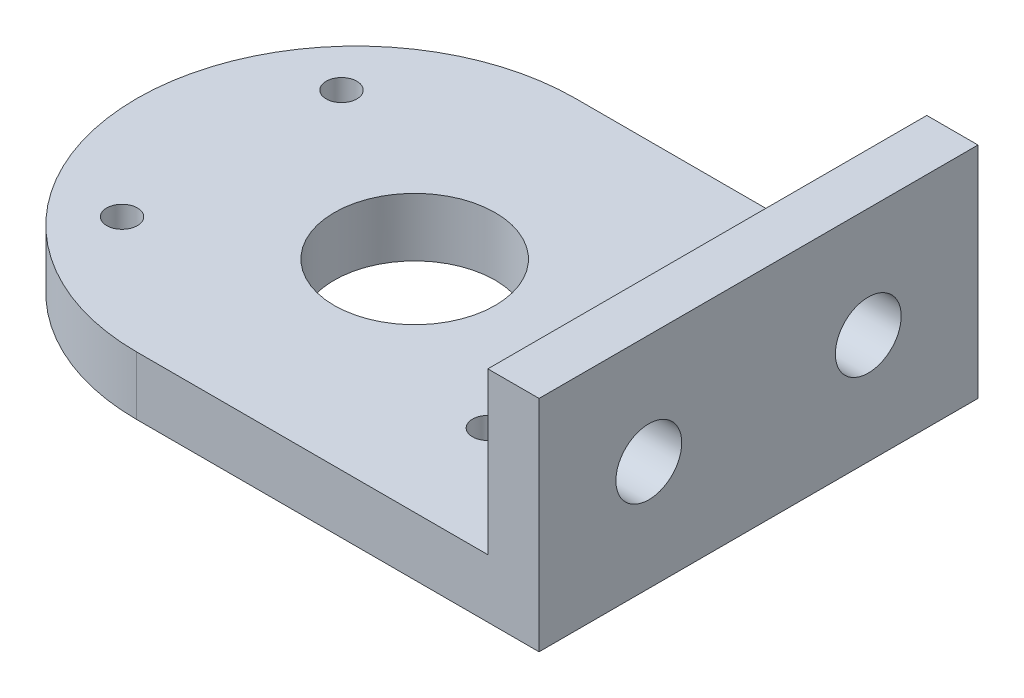
ISO-10303-21;
HEADER;
FILE_DESCRIPTION(('STEP AP214'),'2;1');
FILE_NAME('part.step','',(''),(''),'','','');
FILE_SCHEMA(('AUTOMOTIVE_DESIGN { 1 0 10303 214 1 1 1 1 }'));
ENDSEC;
DATA;
#1=APPLICATION_CONTEXT('core data for automotive mechanical design processes');
#2=APPLICATION_PROTOCOL_DEFINITION('international standard','automotive_design',2000,#1);
#3=PRODUCT_CONTEXT('',#1,'mechanical');
#4=PRODUCT('Part','Part','',(#3));
#5=PRODUCT_RELATED_PRODUCT_CATEGORY('part','',(#4));
#6=PRODUCT_DEFINITION_FORMATION('','',#4);
#7=PRODUCT_DEFINITION_CONTEXT('part definition',#1,'design');
#8=PRODUCT_DEFINITION('design','',#6,#7);
#9=PRODUCT_DEFINITION_SHAPE('','',#8);
#10=(LENGTH_UNIT() NAMED_UNIT(*) SI_UNIT(.MILLI.,.METRE.));
#11=(NAMED_UNIT(*) PLANE_ANGLE_UNIT() SI_UNIT($,.RADIAN.));
#12=(NAMED_UNIT(*) SI_UNIT($,.STERADIAN.) SOLID_ANGLE_UNIT());
#13=UNCERTAINTY_MEASURE_WITH_UNIT(LENGTH_MEASURE(1.E-05),#10,'distance_accuracy_value','');
#14=(GEOMETRIC_REPRESENTATION_CONTEXT(3) GLOBAL_UNCERTAINTY_ASSIGNED_CONTEXT((#13)) GLOBAL_UNIT_ASSIGNED_CONTEXT((#10,
#11,#12)) REPRESENTATION_CONTEXT('',''));
#15=CARTESIAN_POINT('',(0.,0.,0.));
#16=DIRECTION('',(0.,0.,1.));
#17=DIRECTION('',(1.,0.,0.));
#18=AXIS2_PLACEMENT_3D('',#15,#16,#17);
#19=CARTESIAN_POINT('',(40.25,8.,-30.));
#20=DIRECTION('',(-1.,0.,0.));
#21=DIRECTION('',(0.,0.,1.));
#22=AXIS2_PLACEMENT_3D('',#19,#20,#21);
#23=PLANE('',#22);
#24=CARTESIAN_POINT('',(40.25,15.,15.));
#25=DIRECTION('',(1.,0.,0.));
#26=DIRECTION('',(0.,0.,-1.));
#27=AXIS2_PLACEMENT_3D('',#24,#25,#26);
#28=CIRCLE('',#27,4.5);
#29=CARTESIAN_POINT('',(40.25,15.,10.5));
#30=VERTEX_POINT('',#29);
#31=EDGE_CURVE('E193',#30,#30,#28,.T.);
#32=ORIENTED_EDGE('',*,*,#31,.F.);
#33=EDGE_LOOP('',(#32));
#34=FACE_BOUND('',#33,.T.);
#35=CARTESIAN_POINT('',(40.25,15.,-15.));
#36=DIRECTION('',(1.,0.,0.));
#37=DIRECTION('',(0.,0.,-1.));
#38=AXIS2_PLACEMENT_3D('',#35,#36,#37);
#39=CIRCLE('',#38,4.5);
#40=CARTESIAN_POINT('',(40.25,15.,-19.5));
#41=VERTEX_POINT('',#40);
#42=EDGE_CURVE('E196',#41,#41,#39,.T.);
#43=ORIENTED_EDGE('',*,*,#42,.F.);
#44=EDGE_LOOP('',(#43));
#45=FACE_BOUND('',#44,.T.);
#46=DIRECTION('',(0.,0.,-1.));
#47=VECTOR('',#46,1.);
#48=CARTESIAN_POINT('',(40.25,0.,-30.));
#49=LINE('',#48,#47);
#50=CARTESIAN_POINT('',(40.25,0.,30.));
#51=VERTEX_POINT('',#50);
#52=CARTESIAN_POINT('',(40.25,0.,-30.));
#53=VERTEX_POINT('',#52);
#54=EDGE_CURVE('E104',#51,#53,#49,.T.);
#55=ORIENTED_EDGE('',*,*,#54,.T.);
#56=DIRECTION('',(0.,-1.,0.));
#57=VECTOR('',#56,1.);
#58=CARTESIAN_POINT('',(40.25,8.,-30.));
#59=LINE('',#58,#57);
#60=CARTESIAN_POINT('',(40.25,30.,-30.));
#61=VERTEX_POINT('',#60);
#62=EDGE_CURVE('E11',#61,#53,#59,.T.);
#63=ORIENTED_EDGE('',*,*,#62,.F.);
#64=DIRECTION('',(0.,0.,-1.));
#65=VECTOR('',#64,1.);
#66=CARTESIAN_POINT('',(40.25,30.,-30.));
#67=LINE('',#66,#65);
#68=CARTESIAN_POINT('',(40.25,30.,30.));
#69=VERTEX_POINT('',#68);
#70=EDGE_CURVE('E106',#69,#61,#67,.T.);
#71=ORIENTED_EDGE('',*,*,#70,.F.);
#72=DIRECTION('',(0.,-1.,0.));
#73=VECTOR('',#72,1.);
#74=CARTESIAN_POINT('',(40.25,8.,30.));
#75=LINE('',#74,#73);
#76=EDGE_CURVE('E89',#69,#51,#75,.T.);
#77=ORIENTED_EDGE('',*,*,#76,.T.);
#78=EDGE_LOOP('',(#55,#63,#71,#77));
#79=FACE_BOUND('',#78,.T.);
#80=ADVANCED_FACE('F43',(#34,#45,#79),#23,.F.);
#81=CARTESIAN_POINT('',(-14.75,8.,-30.));
#82=DIRECTION('',(0.,0.,1.));
#83=DIRECTION('',(1.,0.,0.));
#84=AXIS2_PLACEMENT_3D('',#81,#82,#83);
#85=PLANE('',#84);
#86=DIRECTION('',(-1.,0.,0.));
#87=VECTOR('',#86,1.);
#88=CARTESIAN_POINT('',(-14.75,0.,-30.));
#89=LINE('',#88,#87);
#90=CARTESIAN_POINT('',(-14.75,0.,-30.));
#91=VERTEX_POINT('',#90);
#92=EDGE_CURVE('E111',#53,#91,#89,.T.);
#93=ORIENTED_EDGE('',*,*,#92,.T.);
#94=DIRECTION('',(0.,-1.,0.));
#95=VECTOR('',#94,1.);
#96=CARTESIAN_POINT('',(-14.75,8.,-30.));
#97=LINE('',#96,#95);
#98=CARTESIAN_POINT('',(-14.75,8.,-30.));
#99=VERTEX_POINT('',#98);
#100=EDGE_CURVE('E52',#99,#91,#97,.T.);
#101=ORIENTED_EDGE('',*,*,#100,.F.);
#102=DIRECTION('',(-1.,0.,0.));
#103=VECTOR('',#102,1.);
#104=CARTESIAN_POINT('',(-14.75,8.,-30.));
#105=LINE('',#104,#103);
#106=CARTESIAN_POINT('',(33.25,8.,-30.));
#107=VERTEX_POINT('',#106);
#108=EDGE_CURVE('E97',#107,#99,#105,.T.);
#109=ORIENTED_EDGE('',*,*,#108,.F.);
#110=DIRECTION('',(0.,-1.,0.));
#111=VECTOR('',#110,1.);
#112=CARTESIAN_POINT('',(33.25,30.,-30.));
#113=LINE('',#112,#111);
#114=CARTESIAN_POINT('',(33.25,30.,-30.));
#115=VERTEX_POINT('',#114);
#116=EDGE_CURVE('E113',#115,#107,#113,.T.);
#117=ORIENTED_EDGE('',*,*,#116,.F.);
#118=DIRECTION('',(-1.,0.,0.));
#119=VECTOR('',#118,1.);
#120=CARTESIAN_POINT('',(40.25,30.,-30.));
#121=LINE('',#120,#119);
#122=EDGE_CURVE('E139',#61,#115,#121,.T.);
#123=ORIENTED_EDGE('',*,*,#122,.F.);
#124=ORIENTED_EDGE('',*,*,#62,.T.);
#125=EDGE_LOOP('',(#93,#101,#109,#117,#123,#124));
#126=FACE_BOUND('',#125,.T.);
#127=ADVANCED_FACE('F134',(#126),#85,.F.);
#128=CARTESIAN_POINT('',(-14.75,8.,0.));
#129=DIRECTION('',(0.,-1.,0.));
#130=DIRECTION('',(0.,0.,-1.));
#131=AXIS2_PLACEMENT_3D('',#128,#129,#130);
#132=CYLINDRICAL_SURFACE('',#131,30.);
#133=CARTESIAN_POINT('',(-14.75,0.,0.));
#134=DIRECTION('',(0.,1.,0.));
#135=DIRECTION('',(0.,0.,1.));
#136=AXIS2_PLACEMENT_3D('',#133,#134,#135);
#137=CIRCLE('',#136,30.);
#138=CARTESIAN_POINT('',(-14.75,0.,30.));
#139=VERTEX_POINT('',#138);
#140=EDGE_CURVE('E98',#91,#139,#137,.T.);
#141=ORIENTED_EDGE('',*,*,#140,.T.);
#142=DIRECTION('',(0.,-1.,0.));
#143=VECTOR('',#142,1.);
#144=CARTESIAN_POINT('',(-14.75,8.,30.));
#145=LINE('',#144,#143);
#146=CARTESIAN_POINT('',(-14.75,8.,30.));
#147=VERTEX_POINT('',#146);
#148=EDGE_CURVE('E92',#147,#139,#145,.T.);
#149=ORIENTED_EDGE('',*,*,#148,.F.);
#150=CARTESIAN_POINT('',(-14.75,8.,0.));
#151=DIRECTION('',(0.,1.,0.));
#152=DIRECTION('',(0.,0.,1.));
#153=AXIS2_PLACEMENT_3D('',#150,#151,#152);
#154=CIRCLE('',#153,30.);
#155=EDGE_CURVE('E65',#99,#147,#154,.T.);
#156=ORIENTED_EDGE('',*,*,#155,.F.);
#157=ORIENTED_EDGE('',*,*,#100,.T.);
#158=EDGE_LOOP('',(#141,#149,#156,#157));
#159=FACE_BOUND('',#158,.T.);
#160=ADVANCED_FACE('F132',(#159),#132,.T.);
#161=CARTESIAN_POINT('',(-14.75,8.,30.));
#162=DIRECTION('',(0.,0.,-1.));
#163=DIRECTION('',(-1.,0.,0.));
#164=AXIS2_PLACEMENT_3D('',#161,#162,#163);
#165=PLANE('',#164);
#166=DIRECTION('',(1.,0.,0.));
#167=VECTOR('',#166,1.);
#168=CARTESIAN_POINT('',(-14.75,0.,30.));
#169=LINE('',#168,#167);
#170=EDGE_CURVE('E85',#139,#51,#169,.T.);
#171=ORIENTED_EDGE('',*,*,#170,.T.);
#172=ORIENTED_EDGE('',*,*,#76,.F.);
#173=DIRECTION('',(1.,0.,0.));
#174=VECTOR('',#173,1.);
#175=CARTESIAN_POINT('',(40.25,30.,30.));
#176=LINE('',#175,#174);
#177=CARTESIAN_POINT('',(33.25,30.,30.));
#178=VERTEX_POINT('',#177);
#179=EDGE_CURVE('E153',#178,#69,#176,.T.);
#180=ORIENTED_EDGE('',*,*,#179,.F.);
#181=DIRECTION('',(0.,-1.,0.));
#182=VECTOR('',#181,1.);
#183=CARTESIAN_POINT('',(33.25,30.,30.));
#184=LINE('',#183,#182);
#185=CARTESIAN_POINT('',(33.25,8.,30.));
#186=VERTEX_POINT('',#185);
#187=EDGE_CURVE('E119',#178,#186,#184,.T.);
#188=ORIENTED_EDGE('',*,*,#187,.T.);
#189=DIRECTION('',(1.,0.,0.));
#190=VECTOR('',#189,1.);
#191=CARTESIAN_POINT('',(-14.75,8.,30.));
#192=LINE('',#191,#190);
#193=EDGE_CURVE('E108',#147,#186,#192,.T.);
#194=ORIENTED_EDGE('',*,*,#193,.F.);
#195=ORIENTED_EDGE('',*,*,#148,.T.);
#196=EDGE_LOOP('',(#171,#172,#180,#188,#194,#195));
#197=FACE_BOUND('',#196,.T.);
#198=ADVANCED_FACE('F87',(#197),#165,.F.);
#199=CARTESIAN_POINT('',(-14.75,8.,0.));
#200=DIRECTION('',(0.,1.,0.));
#201=DIRECTION('',(0.,0.,1.));
#202=AXIS2_PLACEMENT_3D('',#199,#200,#201);
#203=PLANE('',#202);
#204=CARTESIAN_POINT('',(-6.75,8.,0.));
#205=DIRECTION('',(0.,1.,0.));
#206=DIRECTION('',(0.,0.,1.));
#207=AXIS2_PLACEMENT_3D('',#204,#205,#206);
#208=CIRCLE('',#207,11.);
#209=CARTESIAN_POINT('',(-6.75,8.,11.));
#210=VERTEX_POINT('',#209);
#211=EDGE_CURVE('E243',#210,#210,#208,.T.);
#212=ORIENTED_EDGE('',*,*,#211,.F.);
#213=EDGE_LOOP('',(#212));
#214=FACE_BOUND('',#213,.T.);
#215=CARTESIAN_POINT('',(-31.75,8.,15.));
#216=DIRECTION('',(0.,1.,0.));
#217=DIRECTION('',(0.,0.,1.));
#218=AXIS2_PLACEMENT_3D('',#215,#216,#217);
#219=CIRCLE('',#218,2.1);
#220=CARTESIAN_POINT('',(-31.75,8.,17.1));
#221=VERTEX_POINT('',#220);
#222=EDGE_CURVE('E235',#221,#221,#219,.T.);
#223=ORIENTED_EDGE('',*,*,#222,.F.);
#224=EDGE_LOOP('',(#223));
#225=FACE_BOUND('',#224,.T.);
#226=CARTESIAN_POINT('',(18.25,8.,15.));
#227=DIRECTION('',(0.,1.,0.));
#228=DIRECTION('',(0.,0.,1.));
#229=AXIS2_PLACEMENT_3D('',#226,#227,#228);
#230=CIRCLE('',#229,2.1);
#231=CARTESIAN_POINT('',(18.25,8.,17.1));
#232=VERTEX_POINT('',#231);
#233=EDGE_CURVE('E227',#232,#232,#230,.T.);
#234=ORIENTED_EDGE('',*,*,#233,.F.);
#235=EDGE_LOOP('',(#234));
#236=FACE_BOUND('',#235,.T.);
#237=CARTESIAN_POINT('',(18.25,8.,-15.));
#238=DIRECTION('',(0.,1.,0.));
#239=DIRECTION('',(0.,0.,1.));
#240=AXIS2_PLACEMENT_3D('',#237,#238,#239);
#241=CIRCLE('',#240,2.1);
#242=CARTESIAN_POINT('',(18.25,8.,-12.9));
#243=VERTEX_POINT('',#242);
#244=EDGE_CURVE('E219',#243,#243,#241,.T.);
#245=ORIENTED_EDGE('',*,*,#244,.F.);
#246=EDGE_LOOP('',(#245));
#247=FACE_BOUND('',#246,.T.);
#248=CARTESIAN_POINT('',(-31.75,8.,-15.));
#249=DIRECTION('',(0.,1.,0.));
#250=DIRECTION('',(0.,0.,1.));
#251=AXIS2_PLACEMENT_3D('',#248,#249,#250);
#252=CIRCLE('',#251,2.1);
#253=CARTESIAN_POINT('',(-31.75,8.,-12.9));
#254=VERTEX_POINT('',#253);
#255=EDGE_CURVE('E211',#254,#254,#252,.T.);
#256=ORIENTED_EDGE('',*,*,#255,.F.);
#257=EDGE_LOOP('',(#256));
#258=FACE_BOUND('',#257,.T.);
#259=DIRECTION('',(0.,0.,1.));
#260=VECTOR('',#259,1.);
#261=CARTESIAN_POINT('',(33.25,8.,-30.));
#262=LINE('',#261,#260);
#263=EDGE_CURVE('E59',#107,#186,#262,.T.);
#264=ORIENTED_EDGE('',*,*,#263,.F.);
#265=ORIENTED_EDGE('',*,*,#108,.T.);
#266=ORIENTED_EDGE('',*,*,#155,.T.);
#267=ORIENTED_EDGE('',*,*,#193,.T.);
#268=EDGE_LOOP('',(#264,#265,#266,#267));
#269=FACE_BOUND('',#268,.T.);
#270=ADVANCED_FACE('F171',(#214,#225,#236,#247,#258,#269),#203,.T.);
#271=CARTESIAN_POINT('',(-14.75,0.,0.));
#272=DIRECTION('',(0.,1.,0.));
#273=DIRECTION('',(0.,0.,1.));
#274=AXIS2_PLACEMENT_3D('',#271,#272,#273);
#275=PLANE('',#274);
#276=CARTESIAN_POINT('',(-6.75,0.,0.));
#277=DIRECTION('',(0.,-1.,0.));
#278=DIRECTION('',(0.,0.,-1.));
#279=AXIS2_PLACEMENT_3D('',#276,#277,#278);
#280=CIRCLE('',#279,11.);
#281=CARTESIAN_POINT('',(-6.75,0.,-11.));
#282=VERTEX_POINT('',#281);
#283=EDGE_CURVE('E247',#282,#282,#280,.T.);
#284=ORIENTED_EDGE('',*,*,#283,.F.);
#285=EDGE_LOOP('',(#284));
#286=FACE_BOUND('',#285,.T.);
#287=CARTESIAN_POINT('',(-31.75,0.,15.));
#288=DIRECTION('',(0.,-1.,0.));
#289=DIRECTION('',(0.,0.,-1.));
#290=AXIS2_PLACEMENT_3D('',#287,#288,#289);
#291=CIRCLE('',#290,2.1);
#292=CARTESIAN_POINT('',(-31.75,0.,12.9));
#293=VERTEX_POINT('',#292);
#294=EDGE_CURVE('E239',#293,#293,#291,.T.);
#295=ORIENTED_EDGE('',*,*,#294,.F.);
#296=EDGE_LOOP('',(#295));
#297=FACE_BOUND('',#296,.T.);
#298=CARTESIAN_POINT('',(18.25,0.,15.));
#299=DIRECTION('',(0.,-1.,0.));
#300=DIRECTION('',(0.,0.,-1.));
#301=AXIS2_PLACEMENT_3D('',#298,#299,#300);
#302=CIRCLE('',#301,2.1);
#303=CARTESIAN_POINT('',(18.25,0.,12.9));
#304=VERTEX_POINT('',#303);
#305=EDGE_CURVE('E231',#304,#304,#302,.T.);
#306=ORIENTED_EDGE('',*,*,#305,.F.);
#307=EDGE_LOOP('',(#306));
#308=FACE_BOUND('',#307,.T.);
#309=CARTESIAN_POINT('',(18.25,0.,-15.));
#310=DIRECTION('',(0.,-1.,0.));
#311=DIRECTION('',(0.,0.,-1.));
#312=AXIS2_PLACEMENT_3D('',#309,#310,#311);
#313=CIRCLE('',#312,2.1);
#314=CARTESIAN_POINT('',(18.25,0.,-17.1));
#315=VERTEX_POINT('',#314);
#316=EDGE_CURVE('E223',#315,#315,#313,.T.);
#317=ORIENTED_EDGE('',*,*,#316,.F.);
#318=EDGE_LOOP('',(#317));
#319=FACE_BOUND('',#318,.T.);
#320=CARTESIAN_POINT('',(-31.75,0.,-15.));
#321=DIRECTION('',(0.,-1.,0.));
#322=DIRECTION('',(0.,0.,-1.));
#323=AXIS2_PLACEMENT_3D('',#320,#321,#322);
#324=CIRCLE('',#323,2.1);
#325=CARTESIAN_POINT('',(-31.75,0.,-17.1));
#326=VERTEX_POINT('',#325);
#327=EDGE_CURVE('E215',#326,#326,#324,.T.);
#328=ORIENTED_EDGE('',*,*,#327,.F.);
#329=EDGE_LOOP('',(#328));
#330=FACE_BOUND('',#329,.T.);
#331=ORIENTED_EDGE('',*,*,#54,.F.);
#332=ORIENTED_EDGE('',*,*,#170,.F.);
#333=ORIENTED_EDGE('',*,*,#140,.F.);
#334=ORIENTED_EDGE('',*,*,#92,.F.);
#335=EDGE_LOOP('',(#331,#332,#333,#334));
#336=FACE_BOUND('',#335,.T.);
#337=ADVANCED_FACE('F110',(#286,#297,#308,#319,#330,#336),#275,.F.);
#338=CARTESIAN_POINT('',(33.25,30.,-30.));
#339=DIRECTION('',(1.,0.,0.));
#340=DIRECTION('',(0.,0.,-1.));
#341=AXIS2_PLACEMENT_3D('',#338,#339,#340);
#342=PLANE('',#341);
#343=CARTESIAN_POINT('',(33.25,15.,15.));
#344=DIRECTION('',(1.,0.,0.));
#345=DIRECTION('',(0.,0.,-1.));
#346=AXIS2_PLACEMENT_3D('',#343,#344,#345);
#347=CIRCLE('',#346,4.49999999999999);
#348=CARTESIAN_POINT('',(33.25,15.,10.5));
#349=VERTEX_POINT('',#348);
#350=EDGE_CURVE('E46',#349,#349,#347,.T.);
#351=ORIENTED_EDGE('',*,*,#350,.T.);
#352=EDGE_LOOP('',(#351));
#353=FACE_BOUND('',#352,.T.);
#354=CARTESIAN_POINT('',(33.25,15.,-15.));
#355=DIRECTION('',(1.,0.,0.));
#356=DIRECTION('',(0.,0.,-1.));
#357=AXIS2_PLACEMENT_3D('',#354,#355,#356);
#358=CIRCLE('',#357,4.49999999999999);
#359=CARTESIAN_POINT('',(33.25,15.,-19.5));
#360=VERTEX_POINT('',#359);
#361=EDGE_CURVE('E166',#360,#360,#358,.T.);
#362=ORIENTED_EDGE('',*,*,#361,.T.);
#363=EDGE_LOOP('',(#362));
#364=FACE_BOUND('',#363,.T.);
#365=ORIENTED_EDGE('',*,*,#263,.T.);
#366=ORIENTED_EDGE('',*,*,#187,.F.);
#367=DIRECTION('',(0.,0.,1.));
#368=VECTOR('',#367,1.);
#369=CARTESIAN_POINT('',(33.25,30.,-30.));
#370=LINE('',#369,#368);
#371=EDGE_CURVE('E150',#115,#178,#370,.T.);
#372=ORIENTED_EDGE('',*,*,#371,.F.);
#373=ORIENTED_EDGE('',*,*,#116,.T.);
#374=EDGE_LOOP('',(#365,#366,#372,#373));
#375=FACE_BOUND('',#374,.T.);
#376=ADVANCED_FACE('F158',(#353,#364,#375),#342,.F.);
#377=CARTESIAN_POINT('',(0.,30.,0.));
#378=DIRECTION('',(0.,-1.,0.));
#379=DIRECTION('',(0.,0.,-1.));
#380=AXIS2_PLACEMENT_3D('',#377,#378,#379);
#381=PLANE('',#380);
#382=ORIENTED_EDGE('',*,*,#70,.T.);
#383=ORIENTED_EDGE('',*,*,#122,.T.);
#384=ORIENTED_EDGE('',*,*,#371,.T.);
#385=ORIENTED_EDGE('',*,*,#179,.T.);
#386=EDGE_LOOP('',(#382,#383,#384,#385));
#387=FACE_BOUND('',#386,.T.);
#388=ADVANCED_FACE('F152',(#387),#381,.F.);
#389=CARTESIAN_POINT('',(40.25,15.,-15.));
#390=DIRECTION('',(1.,0.,0.));
#391=DIRECTION('',(0.,0.,-1.));
#392=AXIS2_PLACEMENT_3D('',#389,#390,#391);
#393=CYLINDRICAL_SURFACE('',#392,4.49999999999999);
#394=ORIENTED_EDGE('',*,*,#42,.T.);
#395=EDGE_LOOP('',(#394));
#396=FACE_BOUND('',#395,.T.);
#397=ORIENTED_EDGE('',*,*,#361,.F.);
#398=EDGE_LOOP('',(#397));
#399=FACE_BOUND('',#398,.T.);
#400=ADVANCED_FACE('F275',(#396,#399),#393,.F.);
#401=CARTESIAN_POINT('',(40.25,15.,15.));
#402=DIRECTION('',(1.,0.,0.));
#403=DIRECTION('',(0.,0.,-1.));
#404=AXIS2_PLACEMENT_3D('',#401,#402,#403);
#405=CYLINDRICAL_SURFACE('',#404,4.49999999999999);
#406=ORIENTED_EDGE('',*,*,#31,.T.);
#407=EDGE_LOOP('',(#406));
#408=FACE_BOUND('',#407,.T.);
#409=ORIENTED_EDGE('',*,*,#350,.F.);
#410=EDGE_LOOP('',(#409));
#411=FACE_BOUND('',#410,.T.);
#412=ADVANCED_FACE('F265',(#408,#411),#405,.F.);
#413=CARTESIAN_POINT('',(-31.75,0.,-15.));
#414=DIRECTION('',(0.,-1.,0.));
#415=DIRECTION('',(0.,0.,-1.));
#416=AXIS2_PLACEMENT_3D('',#413,#414,#415);
#417=CYLINDRICAL_SURFACE('',#416,2.1);
#418=ORIENTED_EDGE('',*,*,#255,.T.);
#419=EDGE_LOOP('',(#418));
#420=FACE_BOUND('',#419,.T.);
#421=ORIENTED_EDGE('',*,*,#327,.T.);
#422=EDGE_LOOP('',(#421));
#423=FACE_BOUND('',#422,.T.);
#424=ADVANCED_FACE('F262',(#420,#423),#417,.F.);
#425=CARTESIAN_POINT('',(18.25,0.,-15.));
#426=DIRECTION('',(0.,-1.,0.));
#427=DIRECTION('',(0.,0.,-1.));
#428=AXIS2_PLACEMENT_3D('',#425,#426,#427);
#429=CYLINDRICAL_SURFACE('',#428,2.1);
#430=ORIENTED_EDGE('',*,*,#244,.T.);
#431=EDGE_LOOP('',(#430));
#432=FACE_BOUND('',#431,.T.);
#433=ORIENTED_EDGE('',*,*,#316,.T.);
#434=EDGE_LOOP('',(#433));
#435=FACE_BOUND('',#434,.T.);
#436=ADVANCED_FACE('F264',(#432,#435),#429,.F.);
#437=CARTESIAN_POINT('',(18.25,0.,15.));
#438=DIRECTION('',(0.,-1.,0.));
#439=DIRECTION('',(0.,0.,-1.));
#440=AXIS2_PLACEMENT_3D('',#437,#438,#439);
#441=CYLINDRICAL_SURFACE('',#440,2.1);
#442=ORIENTED_EDGE('',*,*,#233,.T.);
#443=EDGE_LOOP('',(#442));
#444=FACE_BOUND('',#443,.T.);
#445=ORIENTED_EDGE('',*,*,#305,.T.);
#446=EDGE_LOOP('',(#445));
#447=FACE_BOUND('',#446,.T.);
#448=ADVANCED_FACE('F272',(#444,#447),#441,.F.);
#449=CARTESIAN_POINT('',(-31.75,0.,15.));
#450=DIRECTION('',(0.,-1.,0.));
#451=DIRECTION('',(0.,0.,-1.));
#452=AXIS2_PLACEMENT_3D('',#449,#450,#451);
#453=CYLINDRICAL_SURFACE('',#452,2.1);
#454=ORIENTED_EDGE('',*,*,#222,.T.);
#455=EDGE_LOOP('',(#454));
#456=FACE_BOUND('',#455,.T.);
#457=ORIENTED_EDGE('',*,*,#294,.T.);
#458=EDGE_LOOP('',(#457));
#459=FACE_BOUND('',#458,.T.);
#460=ADVANCED_FACE('F333',(#456,#459),#453,.F.);
#461=CARTESIAN_POINT('',(-6.75,10.,0.));
#462=DIRECTION('',(0.,-1.,0.));
#463=DIRECTION('',(0.,0.,-1.));
#464=AXIS2_PLACEMENT_3D('',#461,#462,#463);
#465=CYLINDRICAL_SURFACE('',#464,11.);
#466=ORIENTED_EDGE('',*,*,#211,.T.);
#467=EDGE_LOOP('',(#466));
#468=FACE_BOUND('',#467,.T.);
#469=ORIENTED_EDGE('',*,*,#283,.T.);
#470=EDGE_LOOP('',(#469));
#471=FACE_BOUND('',#470,.T.);
#472=ADVANCED_FACE('F252',(#468,#471),#465,.F.);
#473=CLOSED_SHELL('',(#80,#127,#160,#198,#270,#337,#376,#388,#400,#412,#424,#436,#448,#460,#472));
#474=MANIFOLD_SOLID_BREP('B2',#473);
#475=ADVANCED_BREP_SHAPE_REPRESENTATION('',(#18,#474),#14);
#476=SHAPE_DEFINITION_REPRESENTATION(#9,#475);
ENDSEC;
END-ISO-10303-21;
